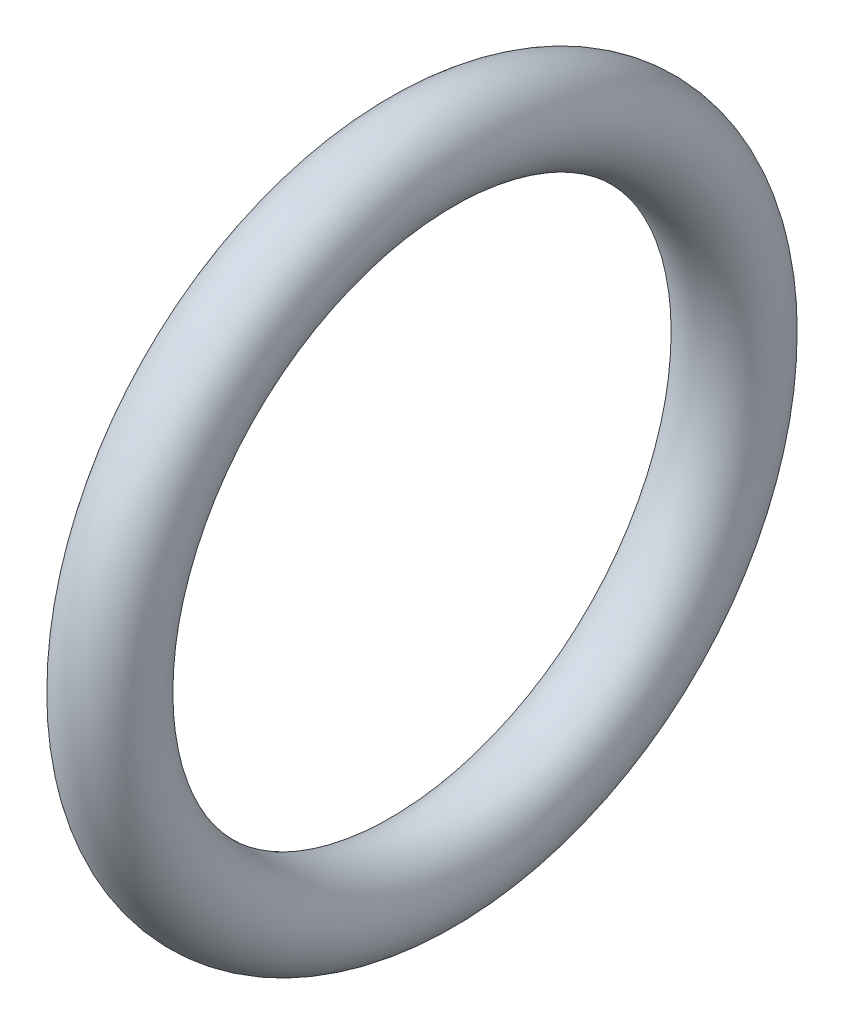
ISO-10303-21;
HEADER;
FILE_DESCRIPTION(('STEP AP214'),'2;1');
FILE_NAME('part.step','',(''),(''),'','','');
FILE_SCHEMA(('AUTOMOTIVE_DESIGN { 1 0 10303 214 1 1 1 1 }'));
ENDSEC;
DATA;
#1=APPLICATION_CONTEXT('core data for automotive mechanical design processes');
#2=APPLICATION_PROTOCOL_DEFINITION('international standard','automotive_design',2000,#1);
#3=PRODUCT_CONTEXT('',#1,'mechanical');
#4=PRODUCT('Part','Part','',(#3));
#5=PRODUCT_RELATED_PRODUCT_CATEGORY('part','',(#4));
#6=PRODUCT_DEFINITION_FORMATION('','',#4);
#7=PRODUCT_DEFINITION_CONTEXT('part definition',#1,'design');
#8=PRODUCT_DEFINITION('design','',#6,#7);
#9=PRODUCT_DEFINITION_SHAPE('','',#8);
#10=(LENGTH_UNIT() NAMED_UNIT(*) SI_UNIT(.MILLI.,.METRE.));
#11=(NAMED_UNIT(*) PLANE_ANGLE_UNIT() SI_UNIT($,.RADIAN.));
#12=(NAMED_UNIT(*) SI_UNIT($,.STERADIAN.) SOLID_ANGLE_UNIT());
#13=UNCERTAINTY_MEASURE_WITH_UNIT(LENGTH_MEASURE(1.E-05),#10,'distance_accuracy_value','');
#14=(GEOMETRIC_REPRESENTATION_CONTEXT(3) GLOBAL_UNCERTAINTY_ASSIGNED_CONTEXT((#13)) GLOBAL_UNIT_ASSIGNED_CONTEXT((#10,
#11,#12)) REPRESENTATION_CONTEXT('',''));
#15=CARTESIAN_POINT('',(0.,0.,0.));
#16=DIRECTION('',(0.,0.,1.));
#17=DIRECTION('',(1.,0.,0.));
#18=AXIS2_PLACEMENT_3D('',#15,#16,#17);
#19=CARTESIAN_POINT('',(0.,0.,0.));
#20=DIRECTION('',(-1.,0.,0.));
#21=DIRECTION('',(0.,0.,1.));
#22=AXIS2_PLACEMENT_3D('',#19,#20,#21);
#23=TOROIDAL_SURFACE('',#22,5.55625,0.79375);
#24=CARTESIAN_POINT('',(0.,0.,6.35));
#25=VERTEX_POINT('',#24);
#26=VERTEX_LOOP('',#25);
#27=FACE_BOUND('',#26,.T.);
#28=ADVANCED_FACE('F356',(#27),#23,.T.);
#29=CLOSED_SHELL('',(#28));
#30=MANIFOLD_SOLID_BREP('B2',#29);
#31=ADVANCED_BREP_SHAPE_REPRESENTATION('',(#18,#30),#14);
#32=SHAPE_DEFINITION_REPRESENTATION(#9,#31);
ENDSEC;
END-ISO-10303-21;
